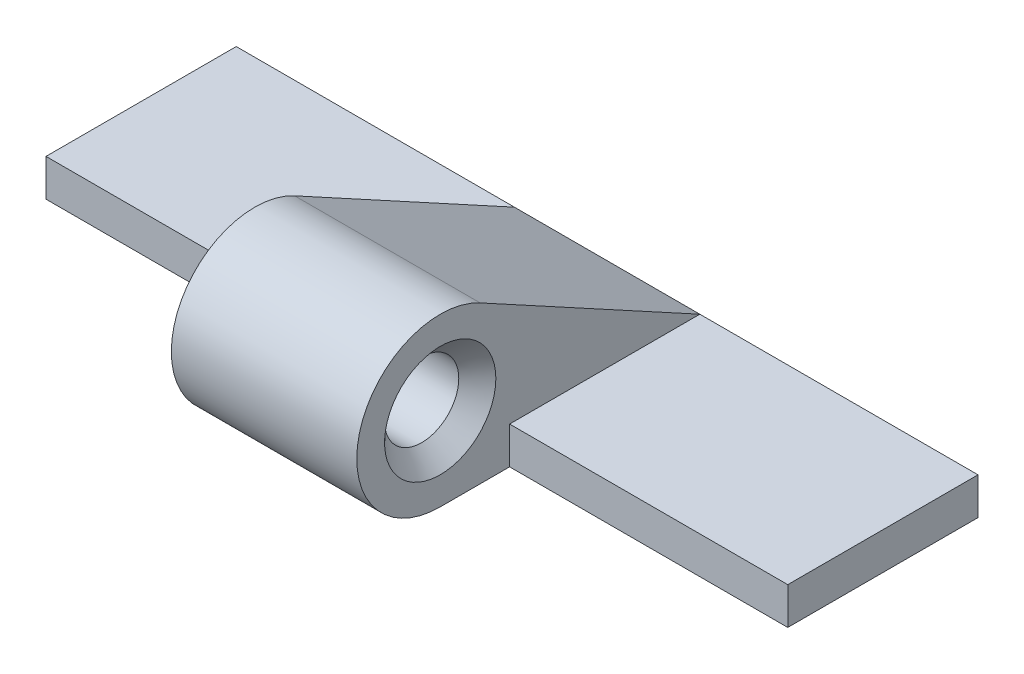
ISO-10303-21;
HEADER;
FILE_DESCRIPTION(('STEP AP214'),'2;1');
FILE_NAME('part.step','',(''),(''),'','','');
FILE_SCHEMA(('AUTOMOTIVE_DESIGN { 1 0 10303 214 1 1 1 1 }'));
ENDSEC;
DATA;
#1=APPLICATION_CONTEXT('core data for automotive mechanical design processes');
#2=APPLICATION_PROTOCOL_DEFINITION('international standard','automotive_design',2000,#1);
#3=PRODUCT_CONTEXT('',#1,'mechanical');
#4=PRODUCT('Part','Part','',(#3));
#5=PRODUCT_RELATED_PRODUCT_CATEGORY('part','',(#4));
#6=PRODUCT_DEFINITION_FORMATION('','',#4);
#7=PRODUCT_DEFINITION_CONTEXT('part definition',#1,'design');
#8=PRODUCT_DEFINITION('design','',#6,#7);
#9=PRODUCT_DEFINITION_SHAPE('','',#8);
#10=(LENGTH_UNIT() NAMED_UNIT(*) SI_UNIT(.MILLI.,.METRE.));
#11=(NAMED_UNIT(*) PLANE_ANGLE_UNIT() SI_UNIT($,.RADIAN.));
#12=(NAMED_UNIT(*) SI_UNIT($,.STERADIAN.) SOLID_ANGLE_UNIT());
#13=UNCERTAINTY_MEASURE_WITH_UNIT(LENGTH_MEASURE(1.E-05),#10,'distance_accuracy_value','');
#14=(GEOMETRIC_REPRESENTATION_CONTEXT(3) GLOBAL_UNCERTAINTY_ASSIGNED_CONTEXT((#13)) GLOBAL_UNIT_ASSIGNED_CONTEXT((#10,
#11,#12)) REPRESENTATION_CONTEXT('',''));
#15=CARTESIAN_POINT('',(0.,0.,0.));
#16=DIRECTION('',(0.,0.,1.));
#17=DIRECTION('',(1.,0.,0.));
#18=AXIS2_PLACEMENT_3D('',#15,#16,#17);
#19=CARTESIAN_POINT('',(-13.8639610306789,2.25,3.5));
#20=DIRECTION('',(1.,0.,0.));
#21=DIRECTION('',(0.,0.,-1.));
#22=AXIS2_PLACEMENT_3D('',#19,#20,#21);
#23=CYLINDRICAL_SURFACE('',#22,2.25);
#24=CARTESIAN_POINT('',(2.5,2.25,3.5));
#25=DIRECTION('',(1.,0.,0.));
#26=DIRECTION('',(0.,0.,-1.));
#27=AXIS2_PLACEMENT_3D('',#24,#25,#26);
#28=CIRCLE('',#27,2.25);
#29=CARTESIAN_POINT('',(2.5,4.22599868104726,2.42392880695584));
#30=VERTEX_POINT('',#29);
#31=CARTESIAN_POINT('',(2.5,0.,3.5));
#32=VERTEX_POINT('',#31);
#33=EDGE_CURVE('E353',#30,#32,#28,.T.);
#34=ORIENTED_EDGE('',*,*,#33,.F.);
#35=DIRECTION('',(1.,0.,0.));
#36=VECTOR('',#35,1.);
#37=CARTESIAN_POINT('',(-9.24536878161602,4.22599868104726,2.42392880695584));
#38=LINE('',#37,#36);
#39=CARTESIAN_POINT('',(-2.5,4.22599868104726,2.42392880695584));
#40=VERTEX_POINT('',#39);
#41=EDGE_CURVE('E124',#40,#30,#38,.T.);
#42=ORIENTED_EDGE('',*,*,#41,.F.);
#43=CARTESIAN_POINT('',(-2.5,2.25,3.5));
#44=DIRECTION('',(1.,0.,0.));
#45=DIRECTION('',(0.,0.,-1.));
#46=AXIS2_PLACEMENT_3D('',#43,#44,#45);
#47=CIRCLE('',#46,2.25);
#48=CARTESIAN_POINT('',(-2.5,0.,3.5));
#49=VERTEX_POINT('',#48);
#50=EDGE_CURVE('E339',#40,#49,#47,.T.);
#51=ORIENTED_EDGE('',*,*,#50,.T.);
#52=DIRECTION('',(1.,0.,0.));
#53=VECTOR('',#52,1.);
#54=CARTESIAN_POINT('',(-7.5,0.,3.5));
#55=LINE('',#54,#53);
#56=EDGE_CURVE('E153',#49,#32,#55,.T.);
#57=ORIENTED_EDGE('',*,*,#56,.T.);
#58=EDGE_LOOP('',(#34,#42,#51,#57));
#59=FACE_BOUND('',#58,.T.);
#60=ADVANCED_FACE('F39',(#59),#23,.T.);
#61=CARTESIAN_POINT('',(0.,1.,0.));
#62=DIRECTION('',(0.,1.,0.));
#63=DIRECTION('',(0.,0.,1.));
#64=AXIS2_PLACEMENT_3D('',#61,#62,#63);
#65=PLANE('',#64);
#66=DIRECTION('',(1.,0.,0.));
#67=VECTOR('',#66,1.);
#68=CARTESIAN_POINT('',(-7.5,1.,1.62917130661303));
#69=LINE('',#68,#67);
#70=CARTESIAN_POINT('',(-10.,0.999999999999999,1.62917130661303));
#71=VERTEX_POINT('',#70);
#72=CARTESIAN_POINT('',(-2.5,1.,1.62917130661303));
#73=VERTEX_POINT('',#72);
#74=EDGE_CURVE('E349',#71,#73,#69,.T.);
#75=ORIENTED_EDGE('',*,*,#74,.T.);
#76=DIRECTION('',(0.,0.,-1.));
#77=VECTOR('',#76,1.);
#78=CARTESIAN_POINT('',(-2.5,1.,3.5));
#79=LINE('',#78,#77);
#80=CARTESIAN_POINT('',(-2.5,1.,-3.5));
#81=VERTEX_POINT('',#80);
#82=EDGE_CURVE('E139',#73,#81,#79,.T.);
#83=ORIENTED_EDGE('',*,*,#82,.T.);
#84=DIRECTION('',(-1.,0.,0.));
#85=VECTOR('',#84,1.);
#86=CARTESIAN_POINT('',(-7.5,1.,-3.5));
#87=LINE('',#86,#85);
#88=CARTESIAN_POINT('',(-10.,1.,-3.5));
#89=VERTEX_POINT('',#88);
#90=EDGE_CURVE('E137',#81,#89,#87,.T.);
#91=ORIENTED_EDGE('',*,*,#90,.T.);
#92=DIRECTION('',(0.,0.,1.));
#93=VECTOR('',#92,1.);
#94=CARTESIAN_POINT('',(-10.,1.,-3.5));
#95=LINE('',#94,#93);
#96=EDGE_CURVE('E324',#89,#71,#95,.T.);
#97=ORIENTED_EDGE('',*,*,#96,.T.);
#98=EDGE_LOOP('',(#75,#83,#91,#97));
#99=FACE_BOUND('',#98,.T.);
#100=ADVANCED_FACE('F181',(#99),#65,.T.);
#101=CARTESIAN_POINT('',(-13.8639610306789,2.25,3.5));
#102=DIRECTION('',(1.,0.,0.));
#103=DIRECTION('',(0.,0.,-1.));
#104=AXIS2_PLACEMENT_3D('',#101,#102,#103);
#105=CYLINDRICAL_SURFACE('',#104,1.);
#106=CARTESIAN_POINT('',(-1.99999999999999,2.25,3.5));
#107=DIRECTION('',(1.,0.,0.));
#108=DIRECTION('',(0.,0.,-1.));
#109=AXIS2_PLACEMENT_3D('',#106,#107,#108);
#110=CIRCLE('',#109,1.);
#111=CARTESIAN_POINT('',(-1.99999999999999,2.25,2.5));
#112=VERTEX_POINT('',#111);
#113=EDGE_CURVE('E151',#112,#112,#110,.F.);
#114=ORIENTED_EDGE('',*,*,#113,.T.);
#115=EDGE_LOOP('',(#114));
#116=FACE_BOUND('',#115,.T.);
#117=CARTESIAN_POINT('',(1.99999999999999,2.25,3.5));
#118=DIRECTION('',(1.,0.,0.));
#119=DIRECTION('',(0.,0.,-1.));
#120=AXIS2_PLACEMENT_3D('',#117,#118,#119);
#121=CIRCLE('',#120,1.);
#122=CARTESIAN_POINT('',(1.99999999999999,2.25,2.5));
#123=VERTEX_POINT('',#122);
#124=EDGE_CURVE('E146',#123,#123,#121,.T.);
#125=ORIENTED_EDGE('',*,*,#124,.T.);
#126=EDGE_LOOP('',(#125));
#127=FACE_BOUND('',#126,.T.);
#128=ADVANCED_FACE('F178',(#116,#127),#105,.F.);
#129=CARTESIAN_POINT('',(-7.5,1.,-3.5));
#130=DIRECTION('',(0.,0.,1.));
#131=DIRECTION('',(1.,0.,0.));
#132=AXIS2_PLACEMENT_3D('',#129,#130,#131);
#133=PLANE('',#132);
#134=DIRECTION('',(-1.,0.,0.));
#135=VECTOR('',#134,1.);
#136=CARTESIAN_POINT('',(-7.5,0.,-3.5));
#137=LINE('',#136,#135);
#138=CARTESIAN_POINT('',(10.,0.,-3.5));
#139=VERTEX_POINT('',#138);
#140=CARTESIAN_POINT('',(-10.,0.,-3.5));
#141=VERTEX_POINT('',#140);
#142=EDGE_CURVE('E158',#139,#141,#137,.T.);
#143=ORIENTED_EDGE('',*,*,#142,.T.);
#144=DIRECTION('',(0.,1.,0.));
#145=VECTOR('',#144,1.);
#146=CARTESIAN_POINT('',(-10.,1.,-3.5));
#147=LINE('',#146,#145);
#148=EDGE_CURVE('E371',#141,#89,#147,.T.);
#149=ORIENTED_EDGE('',*,*,#148,.T.);
#150=ORIENTED_EDGE('',*,*,#90,.F.);
#151=DIRECTION('',(1.,0.,0.));
#152=VECTOR('',#151,1.);
#153=CARTESIAN_POINT('',(-9.24536878161602,1.,-3.5));
#154=LINE('',#153,#152);
#155=CARTESIAN_POINT('',(2.5,1.,-3.5));
#156=VERTEX_POINT('',#155);
#157=EDGE_CURVE('E55',#81,#156,#154,.T.);
#158=ORIENTED_EDGE('',*,*,#157,.T.);
#159=CARTESIAN_POINT('',(10.,1.,-3.5));
#160=VERTEX_POINT('',#159);
#161=EDGE_CURVE('E134',#160,#156,#87,.T.);
#162=ORIENTED_EDGE('',*,*,#161,.F.);
#163=DIRECTION('',(0.,1.,0.));
#164=VECTOR('',#163,1.);
#165=CARTESIAN_POINT('',(10.,1.,-3.5));
#166=LINE('',#165,#164);
#167=EDGE_CURVE('E318',#139,#160,#166,.T.);
#168=ORIENTED_EDGE('',*,*,#167,.F.);
#169=EDGE_LOOP('',(#143,#149,#150,#158,#162,#168));
#170=FACE_BOUND('',#169,.T.);
#171=ADVANCED_FACE('F132',(#170),#133,.F.);
#172=DIRECTION('',(0.,0.,1.));
#173=VECTOR('',#172,1.);
#174=CARTESIAN_POINT('',(2.5,1.,3.5));
#175=LINE('',#174,#173);
#176=CARTESIAN_POINT('',(2.5,1.,1.62917130661303));
#177=VERTEX_POINT('',#176);
#178=EDGE_CURVE('E113',#156,#177,#175,.T.);
#179=ORIENTED_EDGE('',*,*,#178,.T.);
#180=DIRECTION('',(1.,0.,0.));
#181=VECTOR('',#180,1.);
#182=CARTESIAN_POINT('',(-13.8639610306789,1.,1.62917130661303));
#183=LINE('',#182,#181);
#184=CARTESIAN_POINT('',(10.,0.999999999999999,1.62917130661303));
#185=VERTEX_POINT('',#184);
#186=EDGE_CURVE('E156',#185,#177,#183,.F.);
#187=ORIENTED_EDGE('',*,*,#186,.F.);
#188=DIRECTION('',(0.,0.,1.));
#189=VECTOR('',#188,1.);
#190=CARTESIAN_POINT('',(10.,1.,-3.5));
#191=LINE('',#190,#189);
#192=EDGE_CURVE('E143',#160,#185,#191,.T.);
#193=ORIENTED_EDGE('',*,*,#192,.F.);
#194=ORIENTED_EDGE('',*,*,#161,.T.);
#195=EDGE_LOOP('',(#179,#187,#193,#194));
#196=FACE_BOUND('',#195,.T.);
#197=ADVANCED_FACE('F141',(#196),#65,.T.);
#198=CARTESIAN_POINT('',(0.,0.,0.));
#199=DIRECTION('',(0.,1.,0.));
#200=DIRECTION('',(0.,0.,1.));
#201=AXIS2_PLACEMENT_3D('',#198,#199,#200);
#202=PLANE('',#201);
#203=DIRECTION('',(0.,0.,-1.));
#204=VECTOR('',#203,1.);
#205=CARTESIAN_POINT('',(-2.5,0.,1.62917130661303));
#206=LINE('',#205,#204);
#207=CARTESIAN_POINT('',(-2.5,0.,1.62917130661303));
#208=VERTEX_POINT('',#207);
#209=EDGE_CURVE('E342',#49,#208,#206,.T.);
#210=ORIENTED_EDGE('',*,*,#209,.T.);
#211=DIRECTION('',(1.,0.,0.));
#212=VECTOR('',#211,1.);
#213=CARTESIAN_POINT('',(-7.5,0.,1.62917130661303));
#214=LINE('',#213,#212);
#215=CARTESIAN_POINT('',(-10.,0.,1.62917130661303));
#216=VERTEX_POINT('',#215);
#217=EDGE_CURVE('E348',#216,#208,#214,.T.);
#218=ORIENTED_EDGE('',*,*,#217,.F.);
#219=DIRECTION('',(0.,0.,-1.));
#220=VECTOR('',#219,1.);
#221=CARTESIAN_POINT('',(-10.,0.,-3.5));
#222=LINE('',#221,#220);
#223=EDGE_CURVE('E369',#216,#141,#222,.T.);
#224=ORIENTED_EDGE('',*,*,#223,.T.);
#225=ORIENTED_EDGE('',*,*,#142,.F.);
#226=DIRECTION('',(0.,0.,-1.));
#227=VECTOR('',#226,1.);
#228=CARTESIAN_POINT('',(10.,0.,-3.5));
#229=LINE('',#228,#227);
#230=CARTESIAN_POINT('',(10.,0.,1.62917130661303));
#231=VERTEX_POINT('',#230);
#232=EDGE_CURVE('E322',#231,#139,#229,.T.);
#233=ORIENTED_EDGE('',*,*,#232,.F.);
#234=DIRECTION('',(1.,0.,0.));
#235=VECTOR('',#234,1.);
#236=CARTESIAN_POINT('',(2.5,0.,1.62917130661303));
#237=LINE('',#236,#235);
#238=CARTESIAN_POINT('',(2.5,0.,1.62917130661303));
#239=VERTEX_POINT('',#238);
#240=EDGE_CURVE('E362',#239,#231,#237,.T.);
#241=ORIENTED_EDGE('',*,*,#240,.F.);
#242=DIRECTION('',(0.,0.,-1.));
#243=VECTOR('',#242,1.);
#244=CARTESIAN_POINT('',(2.5,0.,1.62917130661303));
#245=LINE('',#244,#243);
#246=EDGE_CURVE('E358',#32,#239,#245,.T.);
#247=ORIENTED_EDGE('',*,*,#246,.F.);
#248=ORIENTED_EDGE('',*,*,#56,.F.);
#249=EDGE_LOOP('',(#210,#218,#224,#225,#233,#241,#247,#248));
#250=FACE_BOUND('',#249,.T.);
#251=ADVANCED_FACE('F190',(#250),#202,.F.);
#252=CARTESIAN_POINT('',(2.5,2.25,3.5));
#253=DIRECTION('',(1.,0.,0.));
#254=DIRECTION('',(0.,0.,-1.));
#255=AXIS2_PLACEMENT_3D('',#252,#253,#254);
#256=PLANE('',#255);
#257=DIRECTION('',(0.,1.,0.));
#258=VECTOR('',#257,1.);
#259=CARTESIAN_POINT('',(2.5,1.,1.62917130661303));
#260=LINE('',#259,#258);
#261=EDGE_CURVE('E119',#239,#177,#260,.T.);
#262=ORIENTED_EDGE('',*,*,#261,.T.);
#263=ORIENTED_EDGE('',*,*,#178,.F.);
#264=DIRECTION('',(0.,-0.47825386357518,-0.878221636021007));
#265=VECTOR('',#264,1.);
#266=CARTESIAN_POINT('',(2.5,4.22599868104726,2.42392880695584));
#267=LINE('',#266,#265);
#268=EDGE_CURVE('E116',#30,#156,#267,.T.);
#269=ORIENTED_EDGE('',*,*,#268,.F.);
#270=ORIENTED_EDGE('',*,*,#33,.T.);
#271=ORIENTED_EDGE('',*,*,#246,.T.);
#272=EDGE_LOOP('',(#262,#263,#269,#270,#271));
#273=FACE_BOUND('',#272,.T.);
#274=CARTESIAN_POINT('',(2.5,2.25,3.5));
#275=DIRECTION('',(1.,0.,0.));
#276=DIRECTION('',(0.,0.,-1.));
#277=AXIS2_PLACEMENT_3D('',#274,#275,#276);
#278=CIRCLE('',#277,1.49999999999999);
#279=CARTESIAN_POINT('',(2.5,2.25,2.00000000000001));
#280=VERTEX_POINT('',#279);
#281=EDGE_CURVE('E11',#280,#280,#278,.F.);
#282=ORIENTED_EDGE('',*,*,#281,.T.);
#283=EDGE_LOOP('',(#282));
#284=FACE_BOUND('',#283,.T.);
#285=ADVANCED_FACE('F114',(#273,#284),#256,.T.);
#286=CARTESIAN_POINT('',(2.5,1.,1.62917130661303));
#287=DIRECTION('',(0.,0.,-1.));
#288=DIRECTION('',(-1.,0.,0.));
#289=AXIS2_PLACEMENT_3D('',#286,#287,#288);
#290=PLANE('',#289);
#291=ORIENTED_EDGE('',*,*,#240,.T.);
#292=DIRECTION('',(0.,-1.,0.));
#293=VECTOR('',#292,1.);
#294=CARTESIAN_POINT('',(10.,0.999999999999999,1.62917130661303));
#295=LINE('',#294,#293);
#296=EDGE_CURVE('E328',#185,#231,#295,.T.);
#297=ORIENTED_EDGE('',*,*,#296,.F.);
#298=ORIENTED_EDGE('',*,*,#186,.T.);
#299=ORIENTED_EDGE('',*,*,#261,.F.);
#300=EDGE_LOOP('',(#291,#297,#298,#299));
#301=FACE_BOUND('',#300,.T.);
#302=ADVANCED_FACE('F189',(#301),#290,.F.);
#303=CARTESIAN_POINT('',(-2.5,2.25,3.5));
#304=DIRECTION('',(1.,0.,0.));
#305=DIRECTION('',(0.,0.,-1.));
#306=AXIS2_PLACEMENT_3D('',#303,#304,#305);
#307=PLANE('',#306);
#308=ORIENTED_EDGE('',*,*,#50,.F.);
#309=DIRECTION('',(0.,0.47825386357518,0.878221636021007));
#310=VECTOR('',#309,1.);
#311=CARTESIAN_POINT('',(-2.5,4.22599868104726,2.42392880695584));
#312=LINE('',#311,#310);
#313=EDGE_CURVE('E376',#81,#40,#312,.T.);
#314=ORIENTED_EDGE('',*,*,#313,.F.);
#315=ORIENTED_EDGE('',*,*,#82,.F.);
#316=DIRECTION('',(0.,1.,0.));
#317=VECTOR('',#316,1.);
#318=CARTESIAN_POINT('',(-2.5,1.,1.62917130661303));
#319=LINE('',#318,#317);
#320=EDGE_CURVE('E63',#208,#73,#319,.T.);
#321=ORIENTED_EDGE('',*,*,#320,.F.);
#322=ORIENTED_EDGE('',*,*,#209,.F.);
#323=EDGE_LOOP('',(#308,#314,#315,#321,#322));
#324=FACE_BOUND('',#323,.T.);
#325=CARTESIAN_POINT('',(-2.5,2.25,3.5));
#326=DIRECTION('',(1.,0.,0.));
#327=DIRECTION('',(0.,0.,-1.));
#328=AXIS2_PLACEMENT_3D('',#325,#326,#327);
#329=CIRCLE('',#328,1.50000000000001);
#330=CARTESIAN_POINT('',(-2.5,2.25,1.99999999999999));
#331=VERTEX_POINT('',#330);
#332=EDGE_CURVE('E48',#331,#331,#329,.T.);
#333=ORIENTED_EDGE('',*,*,#332,.T.);
#334=EDGE_LOOP('',(#333));
#335=FACE_BOUND('',#334,.T.);
#336=ADVANCED_FACE('F170',(#324,#335),#307,.F.);
#337=CARTESIAN_POINT('',(-7.5,1.,1.62917130661303));
#338=DIRECTION('',(0.,0.,-1.));
#339=DIRECTION('',(-1.,0.,0.));
#340=AXIS2_PLACEMENT_3D('',#337,#338,#339);
#341=PLANE('',#340);
#342=ORIENTED_EDGE('',*,*,#320,.T.);
#343=ORIENTED_EDGE('',*,*,#74,.F.);
#344=DIRECTION('',(0.,-1.,0.));
#345=VECTOR('',#344,1.);
#346=CARTESIAN_POINT('',(-10.,0.999999999999999,1.62917130661303));
#347=LINE('',#346,#345);
#348=EDGE_CURVE('E331',#71,#216,#347,.T.);
#349=ORIENTED_EDGE('',*,*,#348,.T.);
#350=ORIENTED_EDGE('',*,*,#217,.T.);
#351=EDGE_LOOP('',(#342,#343,#349,#350));
#352=FACE_BOUND('',#351,.T.);
#353=ADVANCED_FACE('F294',(#352),#341,.F.);
#354=CARTESIAN_POINT('',(10.,0.,0.));
#355=DIRECTION('',(-1.,0.,0.));
#356=DIRECTION('',(0.,0.,1.));
#357=AXIS2_PLACEMENT_3D('',#354,#355,#356);
#358=PLANE('',#357);
#359=ORIENTED_EDGE('',*,*,#167,.T.);
#360=ORIENTED_EDGE('',*,*,#192,.T.);
#361=ORIENTED_EDGE('',*,*,#296,.T.);
#362=ORIENTED_EDGE('',*,*,#232,.T.);
#363=EDGE_LOOP('',(#359,#360,#361,#362));
#364=FACE_BOUND('',#363,.T.);
#365=ADVANCED_FACE('F233',(#364),#358,.F.);
#366=CARTESIAN_POINT('',(-10.,0.,0.));
#367=DIRECTION('',(1.,0.,0.));
#368=DIRECTION('',(0.,0.,1.));
#369=AXIS2_PLACEMENT_3D('',#366,#367,#368);
#370=PLANE('',#369);
#371=ORIENTED_EDGE('',*,*,#148,.F.);
#372=ORIENTED_EDGE('',*,*,#223,.F.);
#373=ORIENTED_EDGE('',*,*,#348,.F.);
#374=ORIENTED_EDGE('',*,*,#96,.F.);
#375=EDGE_LOOP('',(#371,#372,#373,#374));
#376=FACE_BOUND('',#375,.T.);
#377=ADVANCED_FACE('F175',(#376),#370,.F.);
#378=CARTESIAN_POINT('',(-1.99999999999999,2.25,3.5));
#379=DIRECTION('',(-1.,0.,0.));
#380=DIRECTION('',(0.,0.,1.));
#381=AXIS2_PLACEMENT_3D('',#378,#379,#380);
#382=CONICAL_SURFACE('',#381,1.,0.785398163397447);
#383=ORIENTED_EDGE('',*,*,#332,.F.);
#384=EDGE_LOOP('',(#383));
#385=FACE_BOUND('',#384,.T.);
#386=ORIENTED_EDGE('',*,*,#113,.F.);
#387=EDGE_LOOP('',(#386));
#388=FACE_BOUND('',#387,.T.);
#389=ADVANCED_FACE('F172',(#385,#388),#382,.F.);
#390=CARTESIAN_POINT('',(2.5,2.25,3.5));
#391=DIRECTION('',(1.,0.,0.));
#392=DIRECTION('',(0.,0.,-1.));
#393=AXIS2_PLACEMENT_3D('',#390,#391,#392);
#394=CONICAL_SURFACE('',#393,1.49999999999999,0.785398163397438);
#395=ORIENTED_EDGE('',*,*,#124,.F.);
#396=EDGE_LOOP('',(#395));
#397=FACE_BOUND('',#396,.T.);
#398=ORIENTED_EDGE('',*,*,#281,.F.);
#399=EDGE_LOOP('',(#398));
#400=FACE_BOUND('',#399,.T.);
#401=ADVANCED_FACE('F41',(#397,#400),#394,.F.);
#402=CARTESIAN_POINT('',(-9.24536878161602,4.22599868104726,2.42392880695584));
#403=DIRECTION('',(0.,-0.878221636021007,0.47825386357518));
#404=DIRECTION('',(0.,-0.47825386357518,-0.878221636021007));
#405=AXIS2_PLACEMENT_3D('',#402,#403,#404);
#406=PLANE('',#405);
#407=ORIENTED_EDGE('',*,*,#157,.F.);
#408=ORIENTED_EDGE('',*,*,#313,.T.);
#409=ORIENTED_EDGE('',*,*,#41,.T.);
#410=ORIENTED_EDGE('',*,*,#268,.T.);
#411=EDGE_LOOP('',(#407,#408,#409,#410));
#412=FACE_BOUND('',#411,.T.);
#413=ADVANCED_FACE('F126',(#412),#406,.F.);
#414=CLOSED_SHELL('',(#60,#100,#128,#171,#197,#251,#285,#302,#336,#353,#365,#377,#389,#401,#413));
#415=MANIFOLD_SOLID_BREP('B2',#414);
#416=ADVANCED_BREP_SHAPE_REPRESENTATION('',(#18,#415),#14);
#417=SHAPE_DEFINITION_REPRESENTATION(#9,#416);
ENDSEC;
END-ISO-10303-21;
